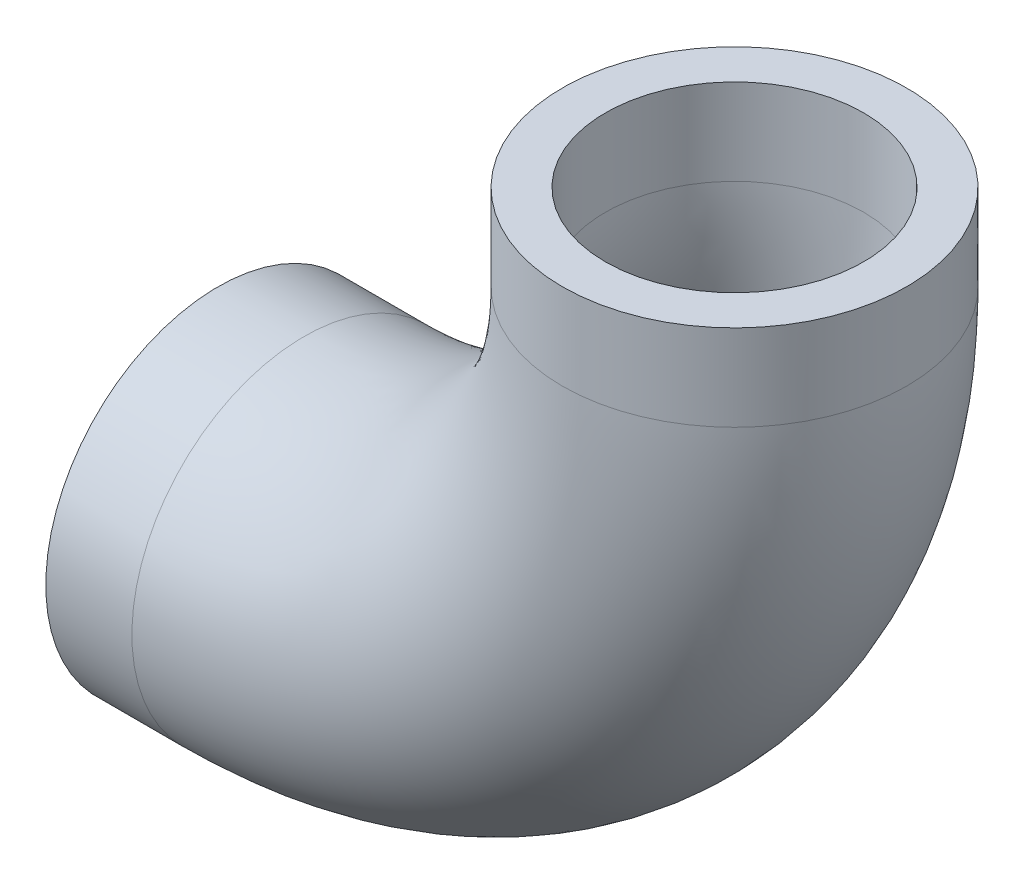
ISO-10303-21;
HEADER;
FILE_DESCRIPTION(('STEP AP214'),'2;1');
FILE_NAME('part.step','',(''),(''),'','','');
FILE_SCHEMA(('AUTOMOTIVE_DESIGN { 1 0 10303 214 1 1 1 1 }'));
ENDSEC;
DATA;
#1=APPLICATION_CONTEXT('core data for automotive mechanical design processes');
#2=APPLICATION_PROTOCOL_DEFINITION('international standard','automotive_design',2000,#1);
#3=PRODUCT_CONTEXT('',#1,'mechanical');
#4=PRODUCT('Part','Part','',(#3));
#5=PRODUCT_RELATED_PRODUCT_CATEGORY('part','',(#4));
#6=PRODUCT_DEFINITION_FORMATION('','',#4);
#7=PRODUCT_DEFINITION_CONTEXT('part definition',#1,'design');
#8=PRODUCT_DEFINITION('design','',#6,#7);
#9=PRODUCT_DEFINITION_SHAPE('','',#8);
#10=(LENGTH_UNIT() NAMED_UNIT(*) SI_UNIT(.MILLI.,.METRE.));
#11=(NAMED_UNIT(*) PLANE_ANGLE_UNIT() SI_UNIT($,.RADIAN.));
#12=(NAMED_UNIT(*) SI_UNIT($,.STERADIAN.) SOLID_ANGLE_UNIT());
#13=UNCERTAINTY_MEASURE_WITH_UNIT(LENGTH_MEASURE(1.E-05),#10,'distance_accuracy_value','');
#14=(GEOMETRIC_REPRESENTATION_CONTEXT(3) GLOBAL_UNCERTAINTY_ASSIGNED_CONTEXT((#13)) GLOBAL_UNIT_ASSIGNED_CONTEXT((#10,
#11,#12)) REPRESENTATION_CONTEXT('',''));
#15=CARTESIAN_POINT('',(0.,0.,0.));
#16=DIRECTION('',(0.,0.,1.));
#17=DIRECTION('',(1.,0.,0.));
#18=AXIS2_PLACEMENT_3D('',#15,#16,#17);
#19=CARTESIAN_POINT('',(6.35,31.75,0.));
#20=DIRECTION('',(0.,0.,1.));
#21=DIRECTION('',(0.,1.,0.));
#22=AXIS2_PLACEMENT_3D('',#19,#20,#21);
#23=TOROIDAL_SURFACE('',#22,31.75,9.525);
#24=CARTESIAN_POINT('',(38.1,31.75,0.));
#25=DIRECTION('',(0.,1.,0.));
#26=DIRECTION('',(0.,0.,1.));
#27=AXIS2_PLACEMENT_3D('',#24,#25,#26);
#28=CIRCLE('',#27,9.525);
#29=CARTESIAN_POINT('',(38.1,31.75,9.525));
#30=VERTEX_POINT('',#29);
#31=EDGE_CURVE('E33',#30,#30,#28,.T.);
#32=ORIENTED_EDGE('',*,*,#31,.T.);
#33=EDGE_LOOP('',(#32));
#34=FACE_BOUND('',#33,.T.);
#35=CARTESIAN_POINT('',(6.35,0.,0.));
#36=DIRECTION('',(1.,0.,0.));
#37=DIRECTION('',(0.,0.,-1.));
#38=AXIS2_PLACEMENT_3D('',#35,#36,#37);
#39=CIRCLE('',#38,9.525);
#40=CARTESIAN_POINT('',(6.35,0.,-9.525));
#41=VERTEX_POINT('',#40);
#42=EDGE_CURVE('E31',#41,#41,#39,.F.);
#43=ORIENTED_EDGE('',*,*,#42,.T.);
#44=EDGE_LOOP('',(#43));
#45=FACE_BOUND('',#44,.T.);
#46=ADVANCED_FACE('F13',(#34,#45),#23,.F.);
#47=CARTESIAN_POINT('',(38.1,31.75,0.));
#48=DIRECTION('',(0.,1.,0.));
#49=DIRECTION('',(0.,0.,1.));
#50=AXIS2_PLACEMENT_3D('',#47,#48,#49);
#51=CYLINDRICAL_SURFACE('',#50,9.525);
#52=CARTESIAN_POINT('',(38.1,38.1,0.));
#53=DIRECTION('',(0.,1.,0.));
#54=DIRECTION('',(0.,0.,1.));
#55=AXIS2_PLACEMENT_3D('',#52,#53,#54);
#56=CIRCLE('',#55,9.525);
#57=CARTESIAN_POINT('',(38.1,38.1,9.525));
#58=VERTEX_POINT('',#57);
#59=EDGE_CURVE('E17',#58,#58,#56,.F.);
#60=ORIENTED_EDGE('',*,*,#59,.F.);
#61=EDGE_LOOP('',(#60));
#62=FACE_BOUND('',#61,.T.);
#63=ORIENTED_EDGE('',*,*,#31,.F.);
#64=EDGE_LOOP('',(#63));
#65=FACE_BOUND('',#64,.T.);
#66=ADVANCED_FACE('F52',(#62,#65),#51,.F.);
#67=CARTESIAN_POINT('',(0.,0.,0.));
#68=DIRECTION('',(1.,0.,0.));
#69=DIRECTION('',(0.,0.,-1.));
#70=AXIS2_PLACEMENT_3D('',#67,#68,#69);
#71=CYLINDRICAL_SURFACE('',#70,9.525);
#72=ORIENTED_EDGE('',*,*,#42,.F.);
#73=EDGE_LOOP('',(#72));
#74=FACE_BOUND('',#73,.T.);
#75=CARTESIAN_POINT('',(0.,0.,0.));
#76=DIRECTION('',(1.,0.,0.));
#77=DIRECTION('',(0.,0.,-1.));
#78=AXIS2_PLACEMENT_3D('',#75,#76,#77);
#79=CIRCLE('',#78,9.525);
#80=CARTESIAN_POINT('',(0.,0.,-9.525));
#81=VERTEX_POINT('',#80);
#82=EDGE_CURVE('E42',#81,#81,#79,.F.);
#83=ORIENTED_EDGE('',*,*,#82,.T.);
#84=EDGE_LOOP('',(#83));
#85=FACE_BOUND('',#84,.T.);
#86=ADVANCED_FACE('F55',(#74,#85),#71,.F.);
#87=CARTESIAN_POINT('',(38.1,38.1,0.));
#88=DIRECTION('',(0.,1.,0.));
#89=DIRECTION('',(0.,0.,1.));
#90=AXIS2_PLACEMENT_3D('',#87,#88,#89);
#91=PLANE('',#90);
#92=ORIENTED_EDGE('',*,*,#59,.T.);
#93=EDGE_LOOP('',(#92));
#94=FACE_BOUND('',#93,.T.);
#95=CARTESIAN_POINT('',(38.1,38.1,0.));
#96=DIRECTION('',(0.,1.,0.));
#97=DIRECTION('',(0.,0.,1.));
#98=AXIS2_PLACEMENT_3D('',#95,#96,#97);
#99=CIRCLE('',#98,12.7);
#100=CARTESIAN_POINT('',(38.1,38.1,12.7));
#101=VERTEX_POINT('',#100);
#102=EDGE_CURVE('E40',#101,#101,#99,.F.);
#103=ORIENTED_EDGE('',*,*,#102,.F.);
#104=EDGE_LOOP('',(#103));
#105=FACE_BOUND('',#104,.T.);
#106=ADVANCED_FACE('F49',(#94,#105),#91,.T.);
#107=CARTESIAN_POINT('',(0.,0.,0.));
#108=DIRECTION('',(1.,0.,0.));
#109=DIRECTION('',(0.,0.,-1.));
#110=AXIS2_PLACEMENT_3D('',#107,#108,#109);
#111=PLANE('',#110);
#112=ORIENTED_EDGE('',*,*,#82,.F.);
#113=EDGE_LOOP('',(#112));
#114=FACE_BOUND('',#113,.T.);
#115=CARTESIAN_POINT('',(0.,0.,0.));
#116=DIRECTION('',(1.,0.,0.));
#117=DIRECTION('',(0.,0.,-1.));
#118=AXIS2_PLACEMENT_3D('',#115,#116,#117);
#119=CIRCLE('',#118,12.7);
#120=CARTESIAN_POINT('',(0.,0.,-12.7));
#121=VERTEX_POINT('',#120);
#122=EDGE_CURVE('E26',#121,#121,#119,.T.);
#123=ORIENTED_EDGE('',*,*,#122,.F.);
#124=EDGE_LOOP('',(#123));
#125=FACE_BOUND('',#124,.T.);
#126=ADVANCED_FACE('F68',(#114,#125),#111,.F.);
#127=CARTESIAN_POINT('',(38.1,31.75,0.));
#128=DIRECTION('',(0.,1.,0.));
#129=DIRECTION('',(0.,0.,1.));
#130=AXIS2_PLACEMENT_3D('',#127,#128,#129);
#131=CYLINDRICAL_SURFACE('',#130,12.7);
#132=ORIENTED_EDGE('',*,*,#102,.T.);
#133=EDGE_LOOP('',(#132));
#134=FACE_BOUND('',#133,.T.);
#135=CARTESIAN_POINT('',(38.1,31.75,0.));
#136=DIRECTION('',(0.,1.,0.));
#137=DIRECTION('',(1.,0.,0.));
#138=AXIS2_PLACEMENT_3D('',#135,#136,#137);
#139=CIRCLE('',#138,12.7);
#140=CARTESIAN_POINT('',(50.8,31.75,0.));
#141=VERTEX_POINT('',#140);
#142=EDGE_CURVE('E21',#141,#141,#139,.F.);
#143=ORIENTED_EDGE('',*,*,#142,.F.);
#144=EDGE_LOOP('',(#143));
#145=FACE_BOUND('',#144,.T.);
#146=ADVANCED_FACE('F78',(#134,#145),#131,.T.);
#147=CARTESIAN_POINT('',(0.,0.,0.));
#148=DIRECTION('',(1.,0.,0.));
#149=DIRECTION('',(0.,0.,-1.));
#150=AXIS2_PLACEMENT_3D('',#147,#148,#149);
#151=CYLINDRICAL_SURFACE('',#150,12.7);
#152=CARTESIAN_POINT('',(6.35,0.,0.));
#153=DIRECTION('',(1.,0.,0.));
#154=DIRECTION('',(0.,-1.,0.));
#155=AXIS2_PLACEMENT_3D('',#152,#153,#154);
#156=CIRCLE('',#155,12.7);
#157=CARTESIAN_POINT('',(6.34999999999999,-12.7,0.));
#158=VERTEX_POINT('',#157);
#159=EDGE_CURVE('E8',#158,#158,#156,.T.);
#160=ORIENTED_EDGE('',*,*,#159,.F.);
#161=EDGE_LOOP('',(#160));
#162=FACE_BOUND('',#161,.T.);
#163=ORIENTED_EDGE('',*,*,#122,.T.);
#164=EDGE_LOOP('',(#163));
#165=FACE_BOUND('',#164,.T.);
#166=ADVANCED_FACE('F72',(#162,#165),#151,.T.);
#167=CARTESIAN_POINT('',(6.35,31.75,0.));
#168=DIRECTION('',(0.,0.,1.));
#169=DIRECTION('',(0.,1.,0.));
#170=AXIS2_PLACEMENT_3D('',#167,#168,#169);
#171=TOROIDAL_SURFACE('',#170,31.75,12.7);
#172=ORIENTED_EDGE('',*,*,#142,.T.);
#173=EDGE_LOOP('',(#172));
#174=FACE_BOUND('',#173,.T.);
#175=ORIENTED_EDGE('',*,*,#159,.T.);
#176=EDGE_LOOP('',(#175));
#177=FACE_BOUND('',#176,.T.);
#178=ADVANCED_FACE('F70',(#174,#177),#171,.T.);
#179=CLOSED_SHELL('',(#46,#66,#86,#106,#126,#146,#166,#178));
#180=MANIFOLD_SOLID_BREP('B1',#179);
#181=ADVANCED_BREP_SHAPE_REPRESENTATION('',(#18,#180),#14);
#182=SHAPE_DEFINITION_REPRESENTATION(#9,#181);
ENDSEC;
END-ISO-10303-21;
